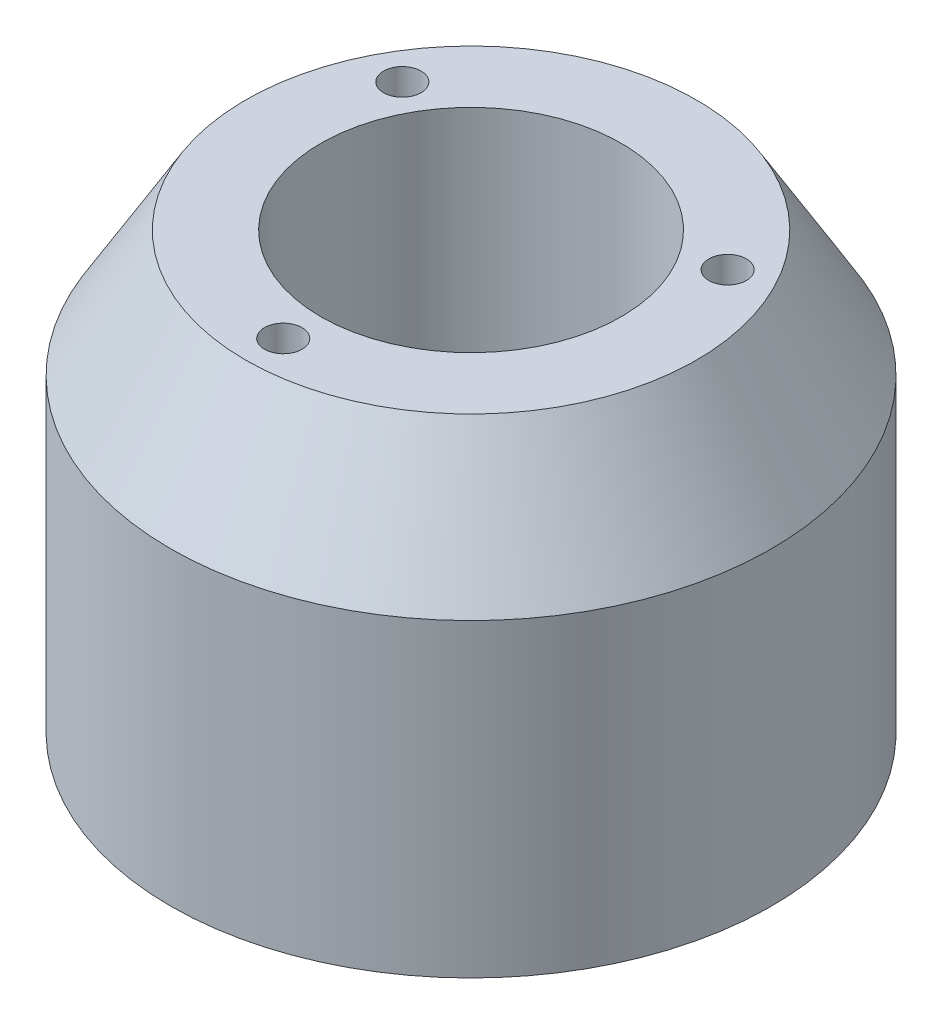
ISO-10303-21;
HEADER;
FILE_DESCRIPTION(('STEP AP214'),'2;1');
FILE_NAME('part.step','',(''),(''),'','','');
FILE_SCHEMA(('AUTOMOTIVE_DESIGN { 1 0 10303 214 1 1 1 1 }'));
ENDSEC;
DATA;
#1=APPLICATION_CONTEXT('core data for automotive mechanical design processes');
#2=APPLICATION_PROTOCOL_DEFINITION('international standard','automotive_design',2000,#1);
#3=PRODUCT_CONTEXT('',#1,'mechanical');
#4=PRODUCT('Part','Part','',(#3));
#5=PRODUCT_RELATED_PRODUCT_CATEGORY('part','',(#4));
#6=PRODUCT_DEFINITION_FORMATION('','',#4);
#7=PRODUCT_DEFINITION_CONTEXT('part definition',#1,'design');
#8=PRODUCT_DEFINITION('design','',#6,#7);
#9=PRODUCT_DEFINITION_SHAPE('','',#8);
#10=(LENGTH_UNIT() NAMED_UNIT(*) SI_UNIT(.MILLI.,.METRE.));
#11=(NAMED_UNIT(*) PLANE_ANGLE_UNIT() SI_UNIT($,.RADIAN.));
#12=(NAMED_UNIT(*) SI_UNIT($,.STERADIAN.) SOLID_ANGLE_UNIT());
#13=UNCERTAINTY_MEASURE_WITH_UNIT(LENGTH_MEASURE(1.E-05),#10,'distance_accuracy_value','');
#14=(GEOMETRIC_REPRESENTATION_CONTEXT(3) GLOBAL_UNCERTAINTY_ASSIGNED_CONTEXT((#13)) GLOBAL_UNIT_ASSIGNED_CONTEXT((#10,
#11,#12)) REPRESENTATION_CONTEXT('',''));
#15=CARTESIAN_POINT('',(0.,0.,0.));
#16=DIRECTION('',(0.,0.,1.));
#17=DIRECTION('',(1.,0.,0.));
#18=AXIS2_PLACEMENT_3D('',#15,#16,#17);
#19=CARTESIAN_POINT('',(0.,0.,0.));
#20=DIRECTION('',(0.,1.,0.));
#21=DIRECTION('',(0.,0.,1.));
#22=AXIS2_PLACEMENT_3D('',#19,#20,#21);
#23=PLANE('',#22);
#24=CARTESIAN_POINT('',(0.,0.,30.));
#25=DIRECTION('',(0.,-1.,0.));
#26=DIRECTION('',(0.,0.,-1.));
#27=AXIS2_PLACEMENT_3D('',#24,#25,#26);
#28=CIRCLE('',#27,2.49999999999999);
#29=CARTESIAN_POINT('',(0.,0.,27.5));
#30=VERTEX_POINT('',#29);
#31=EDGE_CURVE('E89',#30,#30,#28,.T.);
#32=ORIENTED_EDGE('',*,*,#31,.F.);
#33=EDGE_LOOP('',(#32));
#34=FACE_BOUND('',#33,.T.);
#35=CARTESIAN_POINT('',(30.,0.,0.));
#36=DIRECTION('',(0.,-1.,0.));
#37=DIRECTION('',(0.,0.,-1.));
#38=AXIS2_PLACEMENT_3D('',#35,#36,#37);
#39=CIRCLE('',#38,2.49999999999999);
#40=CARTESIAN_POINT('',(30.,0.,-2.49999999999999));
#41=VERTEX_POINT('',#40);
#42=EDGE_CURVE('E88',#41,#41,#39,.T.);
#43=ORIENTED_EDGE('',*,*,#42,.F.);
#44=EDGE_LOOP('',(#43));
#45=FACE_BOUND('',#44,.T.);
#46=CARTESIAN_POINT('',(0.,0.,-30.));
#47=DIRECTION('',(0.,-1.,0.));
#48=DIRECTION('',(0.,0.,-1.));
#49=AXIS2_PLACEMENT_3D('',#46,#47,#48);
#50=CIRCLE('',#49,2.49999999999999);
#51=CARTESIAN_POINT('',(0.,0.,-32.5));
#52=VERTEX_POINT('',#51);
#53=EDGE_CURVE('E99',#52,#52,#50,.T.);
#54=ORIENTED_EDGE('',*,*,#53,.F.);
#55=EDGE_LOOP('',(#54));
#56=FACE_BOUND('',#55,.T.);
#57=CARTESIAN_POINT('',(-30.,0.,0.));
#58=DIRECTION('',(0.,-1.,0.));
#59=DIRECTION('',(0.,0.,-1.));
#60=AXIS2_PLACEMENT_3D('',#57,#58,#59);
#61=CIRCLE('',#60,2.49999999999999);
#62=CARTESIAN_POINT('',(-30.,0.,-2.49999999999999));
#63=VERTEX_POINT('',#62);
#64=EDGE_CURVE('E105',#63,#63,#61,.T.);
#65=ORIENTED_EDGE('',*,*,#64,.F.);
#66=EDGE_LOOP('',(#65));
#67=FACE_BOUND('',#66,.T.);
#68=CARTESIAN_POINT('',(0.,0.,0.));
#69=DIRECTION('',(0.,1.,0.));
#70=DIRECTION('',(0.,0.,1.));
#71=AXIS2_PLACEMENT_3D('',#68,#69,#70);
#72=CIRCLE('',#71,20.);
#73=CARTESIAN_POINT('',(0.,0.,20.));
#74=VERTEX_POINT('',#73);
#75=EDGE_CURVE('E130',#74,#74,#72,.T.);
#76=ORIENTED_EDGE('',*,*,#75,.T.);
#77=EDGE_LOOP('',(#76));
#78=FACE_BOUND('',#77,.T.);
#79=CARTESIAN_POINT('',(0.,0.,0.));
#80=DIRECTION('',(0.,1.,0.));
#81=DIRECTION('',(0.,0.,1.));
#82=AXIS2_PLACEMENT_3D('',#79,#80,#81);
#83=CIRCLE('',#82,40.);
#84=CARTESIAN_POINT('',(0.,0.,40.));
#85=VERTEX_POINT('',#84);
#86=EDGE_CURVE('E13',#85,#85,#83,.T.);
#87=ORIENTED_EDGE('',*,*,#86,.F.);
#88=EDGE_LOOP('',(#87));
#89=FACE_BOUND('',#88,.T.);
#90=ADVANCED_FACE('F49',(#34,#45,#56,#67,#78,#89),#23,.F.);
#91=CARTESIAN_POINT('',(0.,57.9406690427832,0.));
#92=DIRECTION('',(0.,1.,0.));
#93=DIRECTION('',(0.,0.,1.));
#94=AXIS2_PLACEMENT_3D('',#91,#92,#93);
#95=CYLINDRICAL_SURFACE('',#94,40.);
#96=CARTESIAN_POINT('',(0.,41.2,0.));
#97=DIRECTION('',(0.,1.,0.));
#98=DIRECTION('',(0.,0.,1.));
#99=AXIS2_PLACEMENT_3D('',#96,#97,#98);
#100=CIRCLE('',#99,40.);
#101=CARTESIAN_POINT('',(0.,41.2,40.));
#102=VERTEX_POINT('',#101);
#103=EDGE_CURVE('E56',#102,#102,#100,.T.);
#104=ORIENTED_EDGE('',*,*,#103,.F.);
#105=EDGE_LOOP('',(#104));
#106=FACE_BOUND('',#105,.T.);
#107=ORIENTED_EDGE('',*,*,#86,.T.);
#108=EDGE_LOOP('',(#107));
#109=FACE_BOUND('',#108,.T.);
#110=ADVANCED_FACE('F142',(#106,#109),#95,.T.);
#111=CARTESIAN_POINT('',(0.,41.2,0.));
#112=DIRECTION('',(0.,-1.,0.));
#113=DIRECTION('',(0.,0.,-1.));
#114=AXIS2_PLACEMENT_3D('',#111,#112,#113);
#115=CONICAL_SURFACE('',#114,40.,0.538466990906738);
#116=CARTESIAN_POINT('',(0.,57.9406690427832,0.));
#117=DIRECTION('',(0.,1.,0.));
#118=DIRECTION('',(0.,0.,1.));
#119=AXIS2_PLACEMENT_3D('',#116,#117,#118);
#120=CIRCLE('',#119,30.);
#121=CARTESIAN_POINT('',(0.,57.9406690427832,30.));
#122=VERTEX_POINT('',#121);
#123=EDGE_CURVE('E133',#122,#122,#120,.T.);
#124=ORIENTED_EDGE('',*,*,#123,.F.);
#125=EDGE_LOOP('',(#124));
#126=FACE_BOUND('',#125,.T.);
#127=ORIENTED_EDGE('',*,*,#103,.T.);
#128=EDGE_LOOP('',(#127));
#129=FACE_BOUND('',#128,.T.);
#130=ADVANCED_FACE('F140',(#126,#129),#115,.T.);
#131=CARTESIAN_POINT('',(30.,57.9406690427832,0.));
#132=DIRECTION('',(0.,-1.,0.));
#133=DIRECTION('',(0.,0.,-1.));
#134=AXIS2_PLACEMENT_3D('',#131,#132,#133);
#135=PLANE('',#134);
#136=CARTESIAN_POINT('',(-21.6506350946111,57.9406690427832,-12.4999999999998));
#137=DIRECTION('',(0.,1.,0.));
#138=DIRECTION('',(0.,0.,1.));
#139=AXIS2_PLACEMENT_3D('',#136,#137,#138);
#140=CIRCLE('',#139,2.5);
#141=CARTESIAN_POINT('',(-21.6506350946111,57.9406690427832,-9.99999999999978));
#142=VERTEX_POINT('',#141);
#143=EDGE_CURVE('E111',#142,#142,#140,.T.);
#144=ORIENTED_EDGE('',*,*,#143,.F.);
#145=EDGE_LOOP('',(#144));
#146=FACE_BOUND('',#145,.T.);
#147=CARTESIAN_POINT('',(21.6506350946111,57.9406690427832,-12.4999999999998));
#148=DIRECTION('',(0.,1.,0.));
#149=DIRECTION('',(0.,0.,1.));
#150=AXIS2_PLACEMENT_3D('',#147,#148,#149);
#151=CIRCLE('',#150,2.5);
#152=CARTESIAN_POINT('',(21.6506350946111,57.9406690427832,-9.9999999999998));
#153=VERTEX_POINT('',#152);
#154=EDGE_CURVE('E117',#153,#153,#151,.T.);
#155=ORIENTED_EDGE('',*,*,#154,.F.);
#156=EDGE_LOOP('',(#155));
#157=FACE_BOUND('',#156,.T.);
#158=CARTESIAN_POINT('',(0.,57.9406690427832,25.));
#159=DIRECTION('',(0.,1.,0.));
#160=DIRECTION('',(0.,0.,1.));
#161=AXIS2_PLACEMENT_3D('',#158,#159,#160);
#162=CIRCLE('',#161,2.5);
#163=CARTESIAN_POINT('',(0.,57.9406690427832,27.5));
#164=VERTEX_POINT('',#163);
#165=EDGE_CURVE('E123',#164,#164,#162,.T.);
#166=ORIENTED_EDGE('',*,*,#165,.F.);
#167=EDGE_LOOP('',(#166));
#168=FACE_BOUND('',#167,.T.);
#169=CARTESIAN_POINT('',(0.,57.9406690427832,0.));
#170=DIRECTION('',(0.,1.,0.));
#171=DIRECTION('',(0.,0.,1.));
#172=AXIS2_PLACEMENT_3D('',#169,#170,#171);
#173=CIRCLE('',#172,20.);
#174=CARTESIAN_POINT('',(0.,57.9406690427832,20.));
#175=VERTEX_POINT('',#174);
#176=EDGE_CURVE('E129',#175,#175,#173,.T.);
#177=ORIENTED_EDGE('',*,*,#176,.F.);
#178=EDGE_LOOP('',(#177));
#179=FACE_BOUND('',#178,.T.);
#180=ORIENTED_EDGE('',*,*,#123,.T.);
#181=EDGE_LOOP('',(#180));
#182=FACE_BOUND('',#181,.T.);
#183=ADVANCED_FACE('F165',(#146,#157,#168,#179,#182),#135,.F.);
#184=CARTESIAN_POINT('',(0.,0.,0.));
#185=DIRECTION('',(0.,1.,0.));
#186=DIRECTION('',(0.,0.,1.));
#187=AXIS2_PLACEMENT_3D('',#184,#185,#186);
#188=CYLINDRICAL_SURFACE('',#187,20.);
#189=ORIENTED_EDGE('',*,*,#75,.F.);
#190=EDGE_LOOP('',(#189));
#191=FACE_BOUND('',#190,.T.);
#192=ORIENTED_EDGE('',*,*,#176,.T.);
#193=EDGE_LOOP('',(#192));
#194=FACE_BOUND('',#193,.T.);
#195=ADVANCED_FACE('F161',(#191,#194),#188,.F.);
#196=CARTESIAN_POINT('',(0.,40.9406690427832,25.));
#197=DIRECTION('',(0.,1.,0.));
#198=DIRECTION('',(0.,0.,1.));
#199=AXIS2_PLACEMENT_3D('',#196,#197,#198);
#200=CONICAL_SURFACE('',#199,2.5,1.02974425867665);
#201=CARTESIAN_POINT('',(0.,39.4385174952143,25.));
#202=VERTEX_POINT('',#201);
#203=VERTEX_LOOP('',#202);
#204=FACE_BOUND('',#203,.T.);
#205=CARTESIAN_POINT('',(0.,40.9406690427832,25.));
#206=DIRECTION('',(0.,1.,0.));
#207=DIRECTION('',(0.,0.,1.));
#208=AXIS2_PLACEMENT_3D('',#205,#206,#207);
#209=CIRCLE('',#208,2.5);
#210=CARTESIAN_POINT('',(0.,40.9406690427832,27.5));
#211=VERTEX_POINT('',#210);
#212=EDGE_CURVE('E126',#211,#211,#209,.T.);
#213=ORIENTED_EDGE('',*,*,#212,.T.);
#214=EDGE_LOOP('',(#213));
#215=FACE_BOUND('',#214,.T.);
#216=ADVANCED_FACE('F164',(#204,#215),#200,.F.);
#217=CARTESIAN_POINT('',(0.,57.9406690427832,25.));
#218=DIRECTION('',(0.,1.,0.));
#219=DIRECTION('',(0.,0.,1.));
#220=AXIS2_PLACEMENT_3D('',#217,#218,#219);
#221=CYLINDRICAL_SURFACE('',#220,2.5);
#222=ORIENTED_EDGE('',*,*,#212,.F.);
#223=EDGE_LOOP('',(#222));
#224=FACE_BOUND('',#223,.T.);
#225=ORIENTED_EDGE('',*,*,#165,.T.);
#226=EDGE_LOOP('',(#225));
#227=FACE_BOUND('',#226,.T.);
#228=ADVANCED_FACE('F182',(#224,#227),#221,.F.);
#229=CARTESIAN_POINT('',(21.6506350946111,40.9406690427832,-12.4999999999998));
#230=DIRECTION('',(0.,1.,0.));
#231=DIRECTION('',(0.,0.,1.));
#232=AXIS2_PLACEMENT_3D('',#229,#230,#231);
#233=CONICAL_SURFACE('',#232,2.5,1.02974425867665);
#234=CARTESIAN_POINT('',(21.6506350946111,39.4385174952143,-12.4999999999998));
#235=VERTEX_POINT('',#234);
#236=VERTEX_LOOP('',#235);
#237=FACE_BOUND('',#236,.T.);
#238=CARTESIAN_POINT('',(21.6506350946111,40.9406690427832,-12.4999999999998));
#239=DIRECTION('',(0.,1.,0.));
#240=DIRECTION('',(0.,0.,1.));
#241=AXIS2_PLACEMENT_3D('',#238,#239,#240);
#242=CIRCLE('',#241,2.5);
#243=CARTESIAN_POINT('',(21.6506350946111,40.9406690427832,-9.99999999999981));
#244=VERTEX_POINT('',#243);
#245=EDGE_CURVE('E120',#244,#244,#242,.T.);
#246=ORIENTED_EDGE('',*,*,#245,.T.);
#247=EDGE_LOOP('',(#246));
#248=FACE_BOUND('',#247,.T.);
#249=ADVANCED_FACE('F185',(#237,#248),#233,.F.);
#250=CARTESIAN_POINT('',(21.6506350946111,57.9406690427832,-12.4999999999998));
#251=DIRECTION('',(0.,1.,0.));
#252=DIRECTION('',(0.,0.,1.));
#253=AXIS2_PLACEMENT_3D('',#250,#251,#252);
#254=CYLINDRICAL_SURFACE('',#253,2.5);
#255=ORIENTED_EDGE('',*,*,#245,.F.);
#256=EDGE_LOOP('',(#255));
#257=FACE_BOUND('',#256,.T.);
#258=ORIENTED_EDGE('',*,*,#154,.T.);
#259=EDGE_LOOP('',(#258));
#260=FACE_BOUND('',#259,.T.);
#261=ADVANCED_FACE('F189',(#257,#260),#254,.F.);
#262=CARTESIAN_POINT('',(-21.6506350946111,40.9406690427832,-12.4999999999998));
#263=DIRECTION('',(0.,1.,0.));
#264=DIRECTION('',(0.,0.,1.));
#265=AXIS2_PLACEMENT_3D('',#262,#263,#264);
#266=CONICAL_SURFACE('',#265,2.5,1.02974425867665);
#267=CARTESIAN_POINT('',(-21.6506350946111,39.4385174952143,-12.4999999999998));
#268=VERTEX_POINT('',#267);
#269=VERTEX_LOOP('',#268);
#270=FACE_BOUND('',#269,.T.);
#271=CARTESIAN_POINT('',(-21.6506350946111,40.9406690427832,-12.4999999999998));
#272=DIRECTION('',(0.,1.,0.));
#273=DIRECTION('',(0.,0.,1.));
#274=AXIS2_PLACEMENT_3D('',#271,#272,#273);
#275=CIRCLE('',#274,2.5);
#276=CARTESIAN_POINT('',(-21.6506350946111,40.9406690427832,-9.99999999999978));
#277=VERTEX_POINT('',#276);
#278=EDGE_CURVE('E114',#277,#277,#275,.T.);
#279=ORIENTED_EDGE('',*,*,#278,.T.);
#280=EDGE_LOOP('',(#279));
#281=FACE_BOUND('',#280,.T.);
#282=ADVANCED_FACE('F192',(#270,#281),#266,.F.);
#283=CARTESIAN_POINT('',(-21.6506350946111,57.9406690427832,-12.4999999999998));
#284=DIRECTION('',(0.,1.,0.));
#285=DIRECTION('',(0.,0.,1.));
#286=AXIS2_PLACEMENT_3D('',#283,#284,#285);
#287=CYLINDRICAL_SURFACE('',#286,2.5);
#288=ORIENTED_EDGE('',*,*,#278,.F.);
#289=EDGE_LOOP('',(#288));
#290=FACE_BOUND('',#289,.T.);
#291=ORIENTED_EDGE('',*,*,#143,.T.);
#292=EDGE_LOOP('',(#291));
#293=FACE_BOUND('',#292,.T.);
#294=ADVANCED_FACE('F196',(#290,#293),#287,.F.);
#295=CARTESIAN_POINT('',(-30.,28.,0.));
#296=DIRECTION('',(0.,-1.,0.));
#297=DIRECTION('',(0.,0.,-1.));
#298=AXIS2_PLACEMENT_3D('',#295,#296,#297);
#299=CONICAL_SURFACE('',#298,2.5,1.02974425867665);
#300=CARTESIAN_POINT('',(-30.,29.5021515475689,0.));
#301=VERTEX_POINT('',#300);
#302=VERTEX_LOOP('',#301);
#303=FACE_BOUND('',#302,.T.);
#304=CARTESIAN_POINT('',(-30.,28.,0.));
#305=DIRECTION('',(0.,-1.,0.));
#306=DIRECTION('',(0.,0.,-1.));
#307=AXIS2_PLACEMENT_3D('',#304,#305,#306);
#308=CIRCLE('',#307,2.5);
#309=CARTESIAN_POINT('',(-30.,28.,-2.49999999999999));
#310=VERTEX_POINT('',#309);
#311=EDGE_CURVE('E108',#310,#310,#308,.T.);
#312=ORIENTED_EDGE('',*,*,#311,.T.);
#313=EDGE_LOOP('',(#312));
#314=FACE_BOUND('',#313,.T.);
#315=ADVANCED_FACE('F200',(#303,#314),#299,.F.);
#316=CARTESIAN_POINT('',(-30.,0.,0.));
#317=DIRECTION('',(0.,-1.,0.));
#318=DIRECTION('',(0.,0.,-1.));
#319=AXIS2_PLACEMENT_3D('',#316,#317,#318);
#320=CYLINDRICAL_SURFACE('',#319,2.49999999999999);
#321=ORIENTED_EDGE('',*,*,#311,.F.);
#322=EDGE_LOOP('',(#321));
#323=FACE_BOUND('',#322,.T.);
#324=ORIENTED_EDGE('',*,*,#64,.T.);
#325=EDGE_LOOP('',(#324));
#326=FACE_BOUND('',#325,.T.);
#327=ADVANCED_FACE('F204',(#323,#326),#320,.F.);
#328=CARTESIAN_POINT('',(0.,28.,-30.));
#329=DIRECTION('',(0.,-1.,0.));
#330=DIRECTION('',(0.,0.,-1.));
#331=AXIS2_PLACEMENT_3D('',#328,#329,#330);
#332=CONICAL_SURFACE('',#331,2.49999999999999,1.02974425867665);
#333=CARTESIAN_POINT('',(0.,29.5021515475689,-30.));
#334=VERTEX_POINT('',#333);
#335=VERTEX_LOOP('',#334);
#336=FACE_BOUND('',#335,.T.);
#337=CARTESIAN_POINT('',(0.,28.,-30.));
#338=DIRECTION('',(0.,-1.,0.));
#339=DIRECTION('',(0.,0.,-1.));
#340=AXIS2_PLACEMENT_3D('',#337,#338,#339);
#341=CIRCLE('',#340,2.49999999999999);
#342=CARTESIAN_POINT('',(0.,28.,-32.5));
#343=VERTEX_POINT('',#342);
#344=EDGE_CURVE('E102',#343,#343,#341,.T.);
#345=ORIENTED_EDGE('',*,*,#344,.T.);
#346=EDGE_LOOP('',(#345));
#347=FACE_BOUND('',#346,.T.);
#348=ADVANCED_FACE('F208',(#336,#347),#332,.F.);
#349=CARTESIAN_POINT('',(0.,0.,-30.));
#350=DIRECTION('',(0.,-1.,0.));
#351=DIRECTION('',(0.,0.,-1.));
#352=AXIS2_PLACEMENT_3D('',#349,#350,#351);
#353=CYLINDRICAL_SURFACE('',#352,2.49999999999999);
#354=ORIENTED_EDGE('',*,*,#344,.F.);
#355=EDGE_LOOP('',(#354));
#356=FACE_BOUND('',#355,.T.);
#357=ORIENTED_EDGE('',*,*,#53,.T.);
#358=EDGE_LOOP('',(#357));
#359=FACE_BOUND('',#358,.T.);
#360=ADVANCED_FACE('F212',(#356,#359),#353,.F.);
#361=CARTESIAN_POINT('',(30.,28.,0.));
#362=DIRECTION('',(0.,-1.,0.));
#363=DIRECTION('',(0.,0.,-1.));
#364=AXIS2_PLACEMENT_3D('',#361,#362,#363);
#365=CONICAL_SURFACE('',#364,2.5,1.02974425867665);
#366=CARTESIAN_POINT('',(30.,29.5021515475689,0.));
#367=VERTEX_POINT('',#366);
#368=VERTEX_LOOP('',#367);
#369=FACE_BOUND('',#368,.T.);
#370=CARTESIAN_POINT('',(30.,28.,0.));
#371=DIRECTION('',(0.,-1.,0.));
#372=DIRECTION('',(0.,0.,-1.));
#373=AXIS2_PLACEMENT_3D('',#370,#371,#372);
#374=CIRCLE('',#373,2.5);
#375=CARTESIAN_POINT('',(30.,28.,-2.49999999999999));
#376=VERTEX_POINT('',#375);
#377=EDGE_CURVE('E92',#376,#376,#374,.T.);
#378=ORIENTED_EDGE('',*,*,#377,.T.);
#379=EDGE_LOOP('',(#378));
#380=FACE_BOUND('',#379,.T.);
#381=ADVANCED_FACE('F216',(#369,#380),#365,.F.);
#382=CARTESIAN_POINT('',(30.,0.,0.));
#383=DIRECTION('',(0.,-1.,0.));
#384=DIRECTION('',(0.,0.,-1.));
#385=AXIS2_PLACEMENT_3D('',#382,#383,#384);
#386=CYLINDRICAL_SURFACE('',#385,2.49999999999999);
#387=ORIENTED_EDGE('',*,*,#377,.F.);
#388=EDGE_LOOP('',(#387));
#389=FACE_BOUND('',#388,.T.);
#390=ORIENTED_EDGE('',*,*,#42,.T.);
#391=EDGE_LOOP('',(#390));
#392=FACE_BOUND('',#391,.T.);
#393=ADVANCED_FACE('F82',(#389,#392),#386,.F.);
#394=CARTESIAN_POINT('',(0.,28.,30.));
#395=DIRECTION('',(0.,-1.,0.));
#396=DIRECTION('',(0.,0.,-1.));
#397=AXIS2_PLACEMENT_3D('',#394,#395,#396);
#398=CONICAL_SURFACE('',#397,2.49999999999999,1.02974425867665);
#399=CARTESIAN_POINT('',(0.,29.5021515475689,30.));
#400=VERTEX_POINT('',#399);
#401=VERTEX_LOOP('',#400);
#402=FACE_BOUND('',#401,.T.);
#403=CARTESIAN_POINT('',(0.,28.,30.));
#404=DIRECTION('',(0.,-1.,0.));
#405=DIRECTION('',(0.,0.,-1.));
#406=AXIS2_PLACEMENT_3D('',#403,#404,#405);
#407=CIRCLE('',#406,2.49999999999999);
#408=CARTESIAN_POINT('',(0.,28.,27.5));
#409=VERTEX_POINT('',#408);
#410=EDGE_CURVE('E86',#409,#409,#407,.T.);
#411=ORIENTED_EDGE('',*,*,#410,.T.);
#412=EDGE_LOOP('',(#411));
#413=FACE_BOUND('',#412,.T.);
#414=ADVANCED_FACE('F78',(#402,#413),#398,.F.);
#415=CARTESIAN_POINT('',(0.,0.,30.));
#416=DIRECTION('',(0.,-1.,0.));
#417=DIRECTION('',(0.,0.,-1.));
#418=AXIS2_PLACEMENT_3D('',#415,#416,#417);
#419=CYLINDRICAL_SURFACE('',#418,2.49999999999999);
#420=ORIENTED_EDGE('',*,*,#410,.F.);
#421=EDGE_LOOP('',(#420));
#422=FACE_BOUND('',#421,.T.);
#423=ORIENTED_EDGE('',*,*,#31,.T.);
#424=EDGE_LOOP('',(#423));
#425=FACE_BOUND('',#424,.T.);
#426=ADVANCED_FACE('F81',(#422,#425),#419,.F.);
#427=CLOSED_SHELL('',(#90,#110,#130,#183,#195,#216,#228,#249,#261,#282,#294,#315,#327,#348,#360,
#381,#393,#414,#426));
#428=MANIFOLD_SOLID_BREP('B2',#427);
#429=ADVANCED_BREP_SHAPE_REPRESENTATION('',(#18,#428),#14);
#430=SHAPE_DEFINITION_REPRESENTATION(#9,#429);
ENDSEC;
END-ISO-10303-21;
